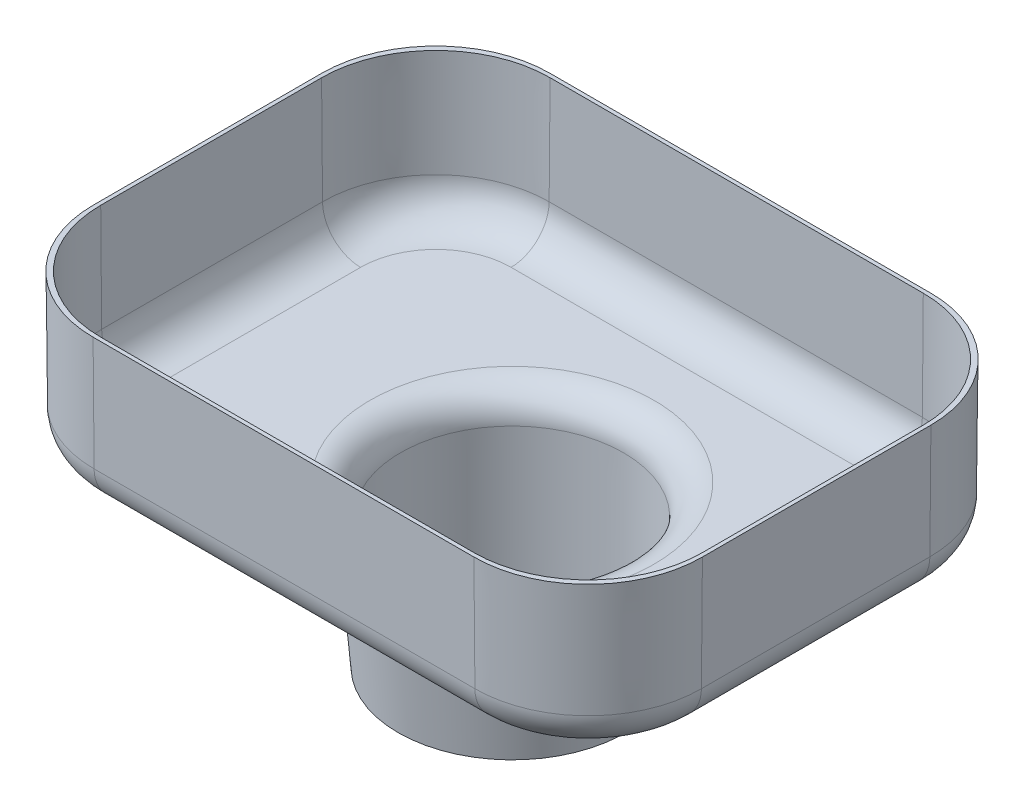
ISO-10303-21;
HEADER;
FILE_DESCRIPTION(('STEP AP214'),'2;1');
FILE_NAME('part.step','',(''),(''),'','','');
FILE_SCHEMA(('AUTOMOTIVE_DESIGN { 1 0 10303 214 1 1 1 1 }'));
ENDSEC;
DATA;
#1=APPLICATION_CONTEXT('core data for automotive mechanical design processes');
#2=APPLICATION_PROTOCOL_DEFINITION('international standard','automotive_design',2000,#1);
#3=PRODUCT_CONTEXT('',#1,'mechanical');
#4=PRODUCT('Part','Part','',(#3));
#5=PRODUCT_RELATED_PRODUCT_CATEGORY('part','',(#4));
#6=PRODUCT_DEFINITION_FORMATION('','',#4);
#7=PRODUCT_DEFINITION_CONTEXT('part definition',#1,'design');
#8=PRODUCT_DEFINITION('design','',#6,#7);
#9=PRODUCT_DEFINITION_SHAPE('','',#8);
#10=(LENGTH_UNIT() NAMED_UNIT(*) SI_UNIT(.MILLI.,.METRE.));
#11=(NAMED_UNIT(*) PLANE_ANGLE_UNIT() SI_UNIT($,.RADIAN.));
#12=(NAMED_UNIT(*) SI_UNIT($,.STERADIAN.) SOLID_ANGLE_UNIT());
#13=UNCERTAINTY_MEASURE_WITH_UNIT(LENGTH_MEASURE(1.E-05),#10,'distance_accuracy_value','');
#14=(GEOMETRIC_REPRESENTATION_CONTEXT(3) GLOBAL_UNCERTAINTY_ASSIGNED_CONTEXT((#13)) GLOBAL_UNIT_ASSIGNED_CONTEXT((#10,
#11,#12)) REPRESENTATION_CONTEXT('',''));
#15=CARTESIAN_POINT('',(0.,0.,0.));
#16=DIRECTION('',(0.,0.,1.));
#17=DIRECTION('',(1.,0.,0.));
#18=AXIS2_PLACEMENT_3D('',#15,#16,#17);
#19=CARTESIAN_POINT('',(36.9314006223956,0.,-13.3160309901822));
#20=DIRECTION('',(0.,1.,0.));
#21=DIRECTION('',(0.,0.,-1.));
#22=AXIS2_PLACEMENT_3D('',#19,#20,#21);
#23=CONICAL_SURFACE('',#22,19.05,0.00872664625997167);
#24=DIRECTION('',(0.00872653549837395,0.999961923064171,0.));
#25=VECTOR('',#24,1.);
#26=CARTESIAN_POINT('',(55.9814006223956,0.,-13.316030990182));
#27=LINE('',#26,#25);
#28=CARTESIAN_POINT('',(55.8146702046897,-19.1054135004147,-13.316030990182));
#29=VERTEX_POINT('',#28);
#30=CARTESIAN_POINT('',(55.9814006223956,0.,-13.316030990182));
#31=VERTEX_POINT('',#30);
#32=EDGE_CURVE('E306',#29,#31,#27,.T.);
#33=ORIENTED_EDGE('',*,*,#32,.F.);
#34=CARTESIAN_POINT('',(36.9314006223956,-19.1054135004145,-13.3160309901822));
#35=DIRECTION('',(0.,-1.,0.));
#36=DIRECTION('',(0.,0.,-1.));
#37=AXIS2_PLACEMENT_3D('',#34,#35,#36);
#38=CIRCLE('',#37,18.8832695822941);
#39=CARTESIAN_POINT('',(36.9314006223954,-19.1054135004147,-32.1993005724763));
#40=VERTEX_POINT('',#39);
#41=EDGE_CURVE('E376',#29,#40,#38,.F.);
#42=ORIENTED_EDGE('',*,*,#41,.T.);
#43=DIRECTION('',(0.,0.999961923064171,-0.00872653549837395));
#44=VECTOR('',#43,1.);
#45=CARTESIAN_POINT('',(36.9314006223954,0.,-32.3660309901822));
#46=LINE('',#45,#44);
#47=CARTESIAN_POINT('',(36.9314006223954,0.,-32.3660309901822));
#48=VERTEX_POINT('',#47);
#49=EDGE_CURVE('E305',#40,#48,#46,.T.);
#50=ORIENTED_EDGE('',*,*,#49,.T.);
#51=CARTESIAN_POINT('',(36.9314006223956,0.,-13.3160309901822));
#52=DIRECTION('',(0.,1.,0.));
#53=DIRECTION('',(0.,0.,-1.));
#54=AXIS2_PLACEMENT_3D('',#51,#52,#53);
#55=CIRCLE('',#54,19.05);
#56=EDGE_CURVE('E257',#31,#48,#55,.T.);
#57=ORIENTED_EDGE('',*,*,#56,.F.);
#58=EDGE_LOOP('',(#33,#42,#50,#57));
#59=FACE_BOUND('',#58,.T.);
#60=ADVANCED_FACE('F39',(#59),#23,.T.);
#61=CARTESIAN_POINT('',(55.9814006223956,0.,-13.316030990182));
#62=DIRECTION('',(0.999961923064171,-0.00872653549837395,0.));
#63=DIRECTION('',(0.00872653549837395,0.999961923064171,0.));
#64=AXIS2_PLACEMENT_3D('',#61,#62,#63);
#65=PLANE('',#64);
#66=DIRECTION('',(0.00872653549837395,0.999961923064171,0.));
#67=VECTOR('',#66,1.);
#68=CARTESIAN_POINT('',(55.9814006223956,0.,24.7839690098177));
#69=LINE('',#68,#67);
#70=CARTESIAN_POINT('',(55.8146702046897,-19.1054135004147,24.7839690098177));
#71=VERTEX_POINT('',#70);
#72=CARTESIAN_POINT('',(55.9814006223956,0.,24.7839690098177));
#73=VERTEX_POINT('',#72);
#74=EDGE_CURVE('E310',#71,#73,#69,.T.);
#75=ORIENTED_EDGE('',*,*,#74,.F.);
#76=DIRECTION('',(0.,0.,-1.));
#77=VECTOR('',#76,1.);
#78=CARTESIAN_POINT('',(55.8146702046897,-19.1054135004147,-13.316030990182));
#79=LINE('',#78,#77);
#80=EDGE_CURVE('E373',#71,#29,#79,.T.);
#81=ORIENTED_EDGE('',*,*,#80,.T.);
#82=ORIENTED_EDGE('',*,*,#32,.T.);
#83=DIRECTION('',(0.,0.,-1.));
#84=VECTOR('',#83,1.);
#85=CARTESIAN_POINT('',(55.9814006223956,0.,-13.316030990182));
#86=LINE('',#85,#84);
#87=EDGE_CURVE('E301',#73,#31,#86,.T.);
#88=ORIENTED_EDGE('',*,*,#87,.F.);
#89=EDGE_LOOP('',(#75,#81,#82,#88));
#90=FACE_BOUND('',#89,.T.);
#91=ADVANCED_FACE('F511',(#90),#65,.T.);
#92=CARTESIAN_POINT('',(36.9314006223956,0.,24.7839690098178));
#93=DIRECTION('',(0.,1.,0.));
#94=DIRECTION('',(0.,0.,1.));
#95=AXIS2_PLACEMENT_3D('',#92,#93,#94);
#96=CONICAL_SURFACE('',#95,19.05,0.00872664625997167);
#97=DIRECTION('',(0.,0.999961923064171,0.00872653549837395));
#98=VECTOR('',#97,1.);
#99=CARTESIAN_POINT('',(36.9314006223954,0.,43.8339690098178));
#100=LINE('',#99,#98);
#101=CARTESIAN_POINT('',(36.9314006223954,-19.1054135004147,43.6672385921119));
#102=VERTEX_POINT('',#101);
#103=CARTESIAN_POINT('',(36.9314006223954,0.,43.8339690098178));
#104=VERTEX_POINT('',#103);
#105=EDGE_CURVE('E325',#102,#104,#100,.T.);
#106=ORIENTED_EDGE('',*,*,#105,.F.);
#107=CARTESIAN_POINT('',(36.9314006223956,-19.1054135004145,24.7839690098178));
#108=DIRECTION('',(0.,-1.,0.));
#109=DIRECTION('',(0.,0.,-1.));
#110=AXIS2_PLACEMENT_3D('',#107,#108,#109);
#111=CIRCLE('',#110,18.8832695822941);
#112=EDGE_CURVE('E370',#102,#71,#111,.F.);
#113=ORIENTED_EDGE('',*,*,#112,.T.);
#114=ORIENTED_EDGE('',*,*,#74,.T.);
#115=CARTESIAN_POINT('',(36.9314006223956,0.,24.7839690098178));
#116=DIRECTION('',(0.,1.,0.));
#117=DIRECTION('',(0.,0.,1.));
#118=AXIS2_PLACEMENT_3D('',#115,#116,#117);
#119=CIRCLE('',#118,19.05);
#120=EDGE_CURVE('E297',#104,#73,#119,.T.);
#121=ORIENTED_EDGE('',*,*,#120,.F.);
#122=EDGE_LOOP('',(#106,#113,#114,#121));
#123=FACE_BOUND('',#122,.T.);
#124=ADVANCED_FACE('F517',(#123),#96,.T.);
#125=CARTESIAN_POINT('',(-26.5685993776043,0.,43.8339690098178));
#126=DIRECTION('',(0.,-0.00872653549837395,0.999961923064171));
#127=DIRECTION('',(0.,-0.999961923064171,-0.00872653549837395));
#128=AXIS2_PLACEMENT_3D('',#125,#126,#127);
#129=PLANE('',#128);
#130=DIRECTION('',(0.,0.999961923064171,0.00872653549837395));
#131=VECTOR('',#130,1.);
#132=CARTESIAN_POINT('',(-26.5685993776044,0.,43.8339690098178));
#133=LINE('',#132,#131);
#134=CARTESIAN_POINT('',(-26.5685993776044,-19.1054135004147,43.6672385921119));
#135=VERTEX_POINT('',#134);
#136=CARTESIAN_POINT('',(-26.5685993776044,0.,43.8339690098178));
#137=VERTEX_POINT('',#136);
#138=EDGE_CURVE('E322',#135,#137,#133,.T.);
#139=ORIENTED_EDGE('',*,*,#138,.F.);
#140=DIRECTION('',(1.,0.,0.));
#141=VECTOR('',#140,1.);
#142=CARTESIAN_POINT('',(-26.5685993776043,-19.1054135004147,43.6672385921119));
#143=LINE('',#142,#141);
#144=EDGE_CURVE('E367',#135,#102,#143,.T.);
#145=ORIENTED_EDGE('',*,*,#144,.T.);
#146=ORIENTED_EDGE('',*,*,#105,.T.);
#147=DIRECTION('',(1.,0.,0.));
#148=VECTOR('',#147,1.);
#149=CARTESIAN_POINT('',(-26.5685993776043,0.,43.8339690098178));
#150=LINE('',#149,#148);
#151=EDGE_CURVE('E293',#137,#104,#150,.T.);
#152=ORIENTED_EDGE('',*,*,#151,.F.);
#153=EDGE_LOOP('',(#139,#145,#146,#152));
#154=FACE_BOUND('',#153,.T.);
#155=ADVANCED_FACE('F540',(#154),#129,.T.);
#156=CARTESIAN_POINT('',(-26.5685993776044,0.,24.7839690098178));
#157=DIRECTION('',(0.,1.,0.));
#158=DIRECTION('',(0.,0.,1.));
#159=AXIS2_PLACEMENT_3D('',#156,#157,#158);
#160=CONICAL_SURFACE('',#159,19.05,0.00872664625997167);
#161=DIRECTION('',(-0.00872653549837395,0.999961923064171,0.));
#162=VECTOR('',#161,1.);
#163=CARTESIAN_POINT('',(-45.6185993776044,0.,24.7839690098177));
#164=LINE('',#163,#162);
#165=CARTESIAN_POINT('',(-45.4518689598985,-19.1054135004147,24.7839690098177));
#166=VERTEX_POINT('',#165);
#167=CARTESIAN_POINT('',(-45.6185993776044,0.,24.7839690098177));
#168=VERTEX_POINT('',#167);
#169=EDGE_CURVE('E319',#166,#168,#164,.T.);
#170=ORIENTED_EDGE('',*,*,#169,.F.);
#171=CARTESIAN_POINT('',(-26.5685993776044,-19.1054135004145,24.7839690098178));
#172=DIRECTION('',(0.,-1.,0.));
#173=DIRECTION('',(0.,0.,-1.));
#174=AXIS2_PLACEMENT_3D('',#171,#172,#173);
#175=CIRCLE('',#174,18.8832695822941);
#176=EDGE_CURVE('E364',#166,#135,#175,.F.);
#177=ORIENTED_EDGE('',*,*,#176,.T.);
#178=ORIENTED_EDGE('',*,*,#138,.T.);
#179=CARTESIAN_POINT('',(-26.5685993776044,0.,24.7839690098178));
#180=DIRECTION('',(0.,1.,0.));
#181=DIRECTION('',(0.,0.,1.));
#182=AXIS2_PLACEMENT_3D('',#179,#180,#181);
#183=CIRCLE('',#182,19.05);
#184=EDGE_CURVE('E289',#168,#137,#183,.T.);
#185=ORIENTED_EDGE('',*,*,#184,.F.);
#186=EDGE_LOOP('',(#170,#177,#178,#185));
#187=FACE_BOUND('',#186,.T.);
#188=ADVANCED_FACE('F536',(#187),#160,.T.);
#189=CARTESIAN_POINT('',(-45.6185993776044,0.,-13.316030990182));
#190=DIRECTION('',(-0.999961923064171,-0.00872653549837395,0.));
#191=DIRECTION('',(0.00872653549837395,-0.999961923064171,0.));
#192=AXIS2_PLACEMENT_3D('',#189,#190,#191);
#193=PLANE('',#192);
#194=DIRECTION('',(-0.00872653549837396,0.999961923064171,0.));
#195=VECTOR('',#194,1.);
#196=CARTESIAN_POINT('',(-45.6185993776044,0.,-13.316030990182));
#197=LINE('',#196,#195);
#198=CARTESIAN_POINT('',(-45.4518689598985,-19.1054135004147,-13.316030990182));
#199=VERTEX_POINT('',#198);
#200=CARTESIAN_POINT('',(-45.6185993776044,0.,-13.316030990182));
#201=VERTEX_POINT('',#200);
#202=EDGE_CURVE('E316',#199,#201,#197,.T.);
#203=ORIENTED_EDGE('',*,*,#202,.F.);
#204=DIRECTION('',(0.,0.,1.));
#205=VECTOR('',#204,1.);
#206=CARTESIAN_POINT('',(-45.4518689598985,-19.1054135004147,-13.316030990182));
#207=LINE('',#206,#205);
#208=EDGE_CURVE('E361',#199,#166,#207,.T.);
#209=ORIENTED_EDGE('',*,*,#208,.T.);
#210=ORIENTED_EDGE('',*,*,#169,.T.);
#211=DIRECTION('',(0.,0.,1.));
#212=VECTOR('',#211,1.);
#213=CARTESIAN_POINT('',(-45.6185993776044,0.,-13.316030990182));
#214=LINE('',#213,#212);
#215=EDGE_CURVE('E285',#201,#168,#214,.T.);
#216=ORIENTED_EDGE('',*,*,#215,.F.);
#217=EDGE_LOOP('',(#203,#209,#210,#216));
#218=FACE_BOUND('',#217,.T.);
#219=ADVANCED_FACE('F532',(#218),#193,.T.);
#220=CARTESIAN_POINT('',(-26.5685993776044,0.,-13.3160309901822));
#221=DIRECTION('',(0.,1.,0.));
#222=DIRECTION('',(0.,0.,1.));
#223=AXIS2_PLACEMENT_3D('',#220,#221,#222);
#224=CONICAL_SURFACE('',#223,19.05,0.00872664625997167);
#225=DIRECTION('',(0.,0.999961923064171,-0.00872653549837395));
#226=VECTOR('',#225,1.);
#227=CARTESIAN_POINT('',(-26.5685993776043,0.,-32.3660309901822));
#228=LINE('',#227,#226);
#229=CARTESIAN_POINT('',(-26.5685993776043,-19.1054135004147,-32.1993005724763));
#230=VERTEX_POINT('',#229);
#231=CARTESIAN_POINT('',(-26.5685993776043,0.,-32.3660309901822));
#232=VERTEX_POINT('',#231);
#233=EDGE_CURVE('E313',#230,#232,#228,.T.);
#234=ORIENTED_EDGE('',*,*,#233,.F.);
#235=CARTESIAN_POINT('',(-26.5685993776044,-19.1054135004145,-13.3160309901822));
#236=DIRECTION('',(0.,-1.,0.));
#237=DIRECTION('',(0.,0.,-1.));
#238=AXIS2_PLACEMENT_3D('',#235,#236,#237);
#239=CIRCLE('',#238,18.8832695822941);
#240=EDGE_CURVE('E358',#230,#199,#239,.F.);
#241=ORIENTED_EDGE('',*,*,#240,.T.);
#242=ORIENTED_EDGE('',*,*,#202,.T.);
#243=CARTESIAN_POINT('',(-26.5685993776044,0.,-13.3160309901822));
#244=DIRECTION('',(0.,1.,0.));
#245=DIRECTION('',(0.,0.,1.));
#246=AXIS2_PLACEMENT_3D('',#243,#244,#245);
#247=CIRCLE('',#246,19.05);
#248=EDGE_CURVE('E281',#232,#201,#247,.T.);
#249=ORIENTED_EDGE('',*,*,#248,.F.);
#250=EDGE_LOOP('',(#234,#241,#242,#249));
#251=FACE_BOUND('',#250,.T.);
#252=ADVANCED_FACE('F528',(#251),#224,.T.);
#253=CARTESIAN_POINT('',(-26.5685993776043,0.,-32.3660309901822));
#254=DIRECTION('',(0.,-0.00872653549837395,-0.999961923064171));
#255=DIRECTION('',(0.,0.999961923064171,-0.00872653549837395));
#256=AXIS2_PLACEMENT_3D('',#253,#254,#255);
#257=PLANE('',#256);
#258=ORIENTED_EDGE('',*,*,#49,.F.);
#259=DIRECTION('',(-1.,0.,0.));
#260=VECTOR('',#259,1.);
#261=CARTESIAN_POINT('',(-26.5685993776043,-19.1054135004147,-32.1993005724763));
#262=LINE('',#261,#260);
#263=EDGE_CURVE('E309',#40,#230,#262,.T.);
#264=ORIENTED_EDGE('',*,*,#263,.T.);
#265=ORIENTED_EDGE('',*,*,#233,.T.);
#266=DIRECTION('',(-1.,0.,0.));
#267=VECTOR('',#266,1.);
#268=CARTESIAN_POINT('',(-26.5685993776043,0.,-32.3660309901822));
#269=LINE('',#268,#267);
#270=EDGE_CURVE('E277',#48,#232,#269,.T.);
#271=ORIENTED_EDGE('',*,*,#270,.F.);
#272=EDGE_LOOP('',(#258,#264,#265,#271));
#273=FACE_BOUND('',#272,.T.);
#274=ADVANCED_FACE('F524',(#273),#257,.T.);
#275=CARTESIAN_POINT('',(36.9314006223956,-25.4,-13.3160309901822));
#276=DIRECTION('',(0.,-1.,0.));
#277=DIRECTION('',(0.,0.,-1.));
#278=AXIS2_PLACEMENT_3D('',#275,#276,#277);
#279=PLANE('',#278);
#280=CARTESIAN_POINT('',(5.18140062239554,-25.4,5.73396900981783));
#281=DIRECTION('',(0.,-1.,0.));
#282=DIRECTION('',(0.,0.,-1.));
#283=AXIS2_PLACEMENT_3D('',#280,#281,#282);
#284=CIRCLE('',#283,25.8639623640085);
#285=CARTESIAN_POINT('',(5.18140062239554,-25.4,-20.1299933541907));
#286=VERTEX_POINT('',#285);
#287=EDGE_CURVE('E11',#286,#286,#284,.F.);
#288=ORIENTED_EDGE('',*,*,#287,.T.);
#289=EDGE_LOOP('',(#288));
#290=FACE_BOUND('',#289,.T.);
#291=CARTESIAN_POINT('',(-26.5685993776044,-25.4,-13.3160309901822));
#292=DIRECTION('',(0.,-1.,0.));
#293=DIRECTION('',(0.,0.,-1.));
#294=AXIS2_PLACEMENT_3D('',#291,#292,#293);
#295=CIRCLE('',#294,12.5335113708366);
#296=CARTESIAN_POINT('',(-39.102110748441,-25.4,-13.3160309901821));
#297=VERTEX_POINT('',#296);
#298=CARTESIAN_POINT('',(-26.5685993776043,-25.4,-25.8495423610188));
#299=VERTEX_POINT('',#298);
#300=EDGE_CURVE('E351',#297,#299,#295,.T.);
#301=ORIENTED_EDGE('',*,*,#300,.T.);
#302=DIRECTION('',(-1.,0.,0.));
#303=VECTOR('',#302,1.);
#304=CARTESIAN_POINT('',(36.9314006223956,-25.4,-25.8495423610188));
#305=LINE('',#304,#303);
#306=CARTESIAN_POINT('',(36.9314006223954,-25.4,-25.8495423610188));
#307=VERTEX_POINT('',#306);
#308=EDGE_CURVE('E354',#299,#307,#305,.F.);
#309=ORIENTED_EDGE('',*,*,#308,.T.);
#310=CARTESIAN_POINT('',(36.9314006223956,-25.4,-13.3160309901822));
#311=DIRECTION('',(0.,-1.,0.));
#312=DIRECTION('',(0.,0.,-1.));
#313=AXIS2_PLACEMENT_3D('',#310,#311,#312);
#314=CIRCLE('',#313,12.5335113708366);
#315=CARTESIAN_POINT('',(49.4649119932322,-25.4,-13.316030990182));
#316=VERTEX_POINT('',#315);
#317=EDGE_CURVE('E333',#307,#316,#314,.T.);
#318=ORIENTED_EDGE('',*,*,#317,.T.);
#319=DIRECTION('',(0.,0.,-1.));
#320=VECTOR('',#319,1.);
#321=CARTESIAN_POINT('',(49.4649119932322,-25.4,-13.3160309901822));
#322=LINE('',#321,#320);
#323=CARTESIAN_POINT('',(49.4649119932322,-25.4,24.7839690098177));
#324=VERTEX_POINT('',#323);
#325=EDGE_CURVE('E336',#316,#324,#322,.F.);
#326=ORIENTED_EDGE('',*,*,#325,.T.);
#327=CARTESIAN_POINT('',(36.9314006223956,-25.4,24.7839690098178));
#328=DIRECTION('',(0.,-1.,0.));
#329=DIRECTION('',(0.,0.,-1.));
#330=AXIS2_PLACEMENT_3D('',#327,#328,#329);
#331=CIRCLE('',#330,12.5335113708366);
#332=CARTESIAN_POINT('',(36.9314006223954,-25.4,37.3174803806544));
#333=VERTEX_POINT('',#332);
#334=EDGE_CURVE('E339',#324,#333,#331,.T.);
#335=ORIENTED_EDGE('',*,*,#334,.T.);
#336=DIRECTION('',(1.,0.,0.));
#337=VECTOR('',#336,1.);
#338=CARTESIAN_POINT('',(36.9314006223956,-25.4,37.3174803806544));
#339=LINE('',#338,#337);
#340=CARTESIAN_POINT('',(-26.5685993776044,-25.4,37.3174803806544));
#341=VERTEX_POINT('',#340);
#342=EDGE_CURVE('E342',#333,#341,#339,.F.);
#343=ORIENTED_EDGE('',*,*,#342,.T.);
#344=CARTESIAN_POINT('',(-26.5685993776044,-25.4,24.7839690098178));
#345=DIRECTION('',(0.,-1.,0.));
#346=DIRECTION('',(0.,0.,-1.));
#347=AXIS2_PLACEMENT_3D('',#344,#345,#346);
#348=CIRCLE('',#347,12.5335113708366);
#349=CARTESIAN_POINT('',(-39.102110748441,-25.4,24.7839690098177));
#350=VERTEX_POINT('',#349);
#351=EDGE_CURVE('E345',#341,#350,#348,.T.);
#352=ORIENTED_EDGE('',*,*,#351,.T.);
#353=DIRECTION('',(0.,0.,1.));
#354=VECTOR('',#353,1.);
#355=CARTESIAN_POINT('',(-39.102110748441,-25.4,-13.3160309901822));
#356=LINE('',#355,#354);
#357=EDGE_CURVE('E348',#350,#297,#356,.F.);
#358=ORIENTED_EDGE('',*,*,#357,.T.);
#359=EDGE_LOOP('',(#301,#309,#318,#326,#335,#343,#352,#358));
#360=FACE_BOUND('',#359,.T.);
#361=ADVANCED_FACE('F527',(#290,#360),#279,.T.);
#362=CARTESIAN_POINT('',(36.9314006223956,0.,-13.3160309901822));
#363=DIRECTION('',(0.,-1.,0.));
#364=DIRECTION('',(0.,0.,-1.));
#365=AXIS2_PLACEMENT_3D('',#362,#363,#364);
#366=PLANE('',#365);
#367=DIRECTION('',(1.,0.,0.));
#368=VECTOR('',#367,1.);
#369=CARTESIAN_POINT('',(-25.9335993776044,0.,43.1989690098178));
#370=LINE('',#369,#368);
#371=CARTESIAN_POINT('',(-25.9335993776044,0.,43.1989690098178));
#372=VERTEX_POINT('',#371);
#373=CARTESIAN_POINT('',(36.2964006223956,0.,43.1989690098178));
#374=VERTEX_POINT('',#373);
#375=EDGE_CURVE('E218',#372,#374,#370,.T.);
#376=ORIENTED_EDGE('',*,*,#375,.F.);
#377=CARTESIAN_POINT('',(-25.9335993776044,0.,24.1489690098178));
#378=DIRECTION('',(0.,1.,0.));
#379=DIRECTION('',(0.,0.,1.));
#380=AXIS2_PLACEMENT_3D('',#377,#378,#379);
#381=CIRCLE('',#380,19.05);
#382=CARTESIAN_POINT('',(-44.9835993776044,0.,24.1489690098178));
#383=VERTEX_POINT('',#382);
#384=EDGE_CURVE('E225',#383,#372,#381,.T.);
#385=ORIENTED_EDGE('',*,*,#384,.F.);
#386=DIRECTION('',(0.,0.,1.));
#387=VECTOR('',#386,1.);
#388=CARTESIAN_POINT('',(-44.9835993776044,0.,-12.6810309901822));
#389=LINE('',#388,#387);
#390=CARTESIAN_POINT('',(-44.9835993776044,0.,-12.6810309901822));
#391=VERTEX_POINT('',#390);
#392=EDGE_CURVE('E250',#391,#383,#389,.T.);
#393=ORIENTED_EDGE('',*,*,#392,.F.);
#394=CARTESIAN_POINT('',(-25.9335993776044,0.,-12.6810309901822));
#395=DIRECTION('',(0.,1.,0.));
#396=DIRECTION('',(0.,0.,1.));
#397=AXIS2_PLACEMENT_3D('',#394,#395,#396);
#398=CIRCLE('',#397,19.05);
#399=CARTESIAN_POINT('',(-25.9335993776044,0.,-31.7310309901822));
#400=VERTEX_POINT('',#399);
#401=EDGE_CURVE('E246',#400,#391,#398,.T.);
#402=ORIENTED_EDGE('',*,*,#401,.F.);
#403=DIRECTION('',(-1.,0.,0.));
#404=VECTOR('',#403,1.);
#405=CARTESIAN_POINT('',(-25.9335993776044,0.,-31.7310309901822));
#406=LINE('',#405,#404);
#407=CARTESIAN_POINT('',(36.2964006223956,0.,-31.7310309901822));
#408=VERTEX_POINT('',#407);
#409=EDGE_CURVE('E242',#408,#400,#406,.T.);
#410=ORIENTED_EDGE('',*,*,#409,.F.);
#411=CARTESIAN_POINT('',(36.2964006223956,0.,-12.6810309901822));
#412=DIRECTION('',(0.,1.,0.));
#413=DIRECTION('',(0.,0.,-1.));
#414=AXIS2_PLACEMENT_3D('',#411,#412,#413);
#415=CIRCLE('',#414,19.05);
#416=CARTESIAN_POINT('',(55.3464006223956,0.,-12.6810309901822));
#417=VERTEX_POINT('',#416);
#418=EDGE_CURVE('E235',#417,#408,#415,.T.);
#419=ORIENTED_EDGE('',*,*,#418,.F.);
#420=DIRECTION('',(0.,0.,-1.));
#421=VECTOR('',#420,1.);
#422=CARTESIAN_POINT('',(55.3464006223956,0.,-12.6810309901822));
#423=LINE('',#422,#421);
#424=CARTESIAN_POINT('',(55.3464006223956,0.,24.1489690098178));
#425=VERTEX_POINT('',#424);
#426=EDGE_CURVE('E231',#425,#417,#423,.T.);
#427=ORIENTED_EDGE('',*,*,#426,.F.);
#428=CARTESIAN_POINT('',(36.2964006223956,0.,24.1489690098178));
#429=DIRECTION('',(0.,1.,0.));
#430=DIRECTION('',(0.,0.,1.));
#431=AXIS2_PLACEMENT_3D('',#428,#429,#430);
#432=CIRCLE('',#431,19.05);
#433=EDGE_CURVE('E207',#374,#425,#432,.T.);
#434=ORIENTED_EDGE('',*,*,#433,.F.);
#435=EDGE_LOOP('',(#376,#385,#393,#402,#410,#419,#427,#434));
#436=FACE_BOUND('',#435,.T.);
#437=ORIENTED_EDGE('',*,*,#56,.T.);
#438=ORIENTED_EDGE('',*,*,#270,.T.);
#439=ORIENTED_EDGE('',*,*,#248,.T.);
#440=ORIENTED_EDGE('',*,*,#215,.T.);
#441=ORIENTED_EDGE('',*,*,#184,.T.);
#442=ORIENTED_EDGE('',*,*,#151,.T.);
#443=ORIENTED_EDGE('',*,*,#120,.T.);
#444=ORIENTED_EDGE('',*,*,#87,.T.);
#445=EDGE_LOOP('',(#437,#438,#439,#440,#441,#442,#443,#444));
#446=FACE_BOUND('',#445,.T.);
#447=ADVANCED_FACE('F227',(#436,#446),#366,.F.);
#448=CARTESIAN_POINT('',(-25.9335993776044,0.,24.1489690098178));
#449=DIRECTION('',(0.,1.,0.));
#450=DIRECTION('',(0.,0.,1.));
#451=AXIS2_PLACEMENT_3D('',#448,#449,#450);
#452=CONICAL_SURFACE('',#451,19.05,0.00872664625997167);
#453=DIRECTION('',(0.,0.999961923064171,0.00872653549837395));
#454=VECTOR('',#453,1.);
#455=CARTESIAN_POINT('',(-25.9335993776044,0.,43.1989690098178));
#456=LINE('',#455,#454);
#457=CARTESIAN_POINT('',(-25.9335993776044,-17.8354135004147,43.0433217142062));
#458=VERTEX_POINT('',#457);
#459=EDGE_CURVE('E215',#458,#372,#456,.T.);
#460=ORIENTED_EDGE('',*,*,#459,.F.);
#461=CARTESIAN_POINT('',(-25.9335993776044,-17.8354135004146,24.1489690098178));
#462=DIRECTION('',(0.,-1.,0.));
#463=DIRECTION('',(0.,0.,-1.));
#464=AXIS2_PLACEMENT_3D('',#461,#462,#463);
#465=CIRCLE('',#464,18.8943527043884);
#466=CARTESIAN_POINT('',(-44.8279520819928,-17.8354135004147,24.1489690098178));
#467=VERTEX_POINT('',#466);
#468=EDGE_CURVE('E444',#458,#467,#465,.T.);
#469=ORIENTED_EDGE('',*,*,#468,.T.);
#470=DIRECTION('',(-0.00872653549837395,0.999961923064171,0.));
#471=VECTOR('',#470,1.);
#472=CARTESIAN_POINT('',(-44.9835993776044,0.,24.1489690098178));
#473=LINE('',#472,#471);
#474=EDGE_CURVE('E254',#467,#383,#473,.T.);
#475=ORIENTED_EDGE('',*,*,#474,.T.);
#476=ORIENTED_EDGE('',*,*,#384,.T.);
#477=EDGE_LOOP('',(#460,#469,#475,#476));
#478=FACE_BOUND('',#477,.T.);
#479=ADVANCED_FACE('F639',(#478),#452,.F.);
#480=CARTESIAN_POINT('',(-44.9835993776044,0.,-12.6810309901822));
#481=DIRECTION('',(-0.999961923064171,-0.00872653549837395,0.));
#482=DIRECTION('',(0.00872653549837395,-0.999961923064171,0.));
#483=AXIS2_PLACEMENT_3D('',#480,#481,#482);
#484=PLANE('',#483);
#485=ORIENTED_EDGE('',*,*,#474,.F.);
#486=DIRECTION('',(0.,0.,1.));
#487=VECTOR('',#486,1.);
#488=CARTESIAN_POINT('',(-44.8279520819928,-17.8354135004147,-12.6810309901822));
#489=LINE('',#488,#487);
#490=CARTESIAN_POINT('',(-44.8279520819928,-17.8354135004147,-12.6810309901822));
#491=VERTEX_POINT('',#490);
#492=EDGE_CURVE('E447',#467,#491,#489,.F.);
#493=ORIENTED_EDGE('',*,*,#492,.T.);
#494=DIRECTION('',(-0.00872653549837395,0.999961923064171,0.));
#495=VECTOR('',#494,1.);
#496=CARTESIAN_POINT('',(-44.9835993776044,0.,-12.6810309901822));
#497=LINE('',#496,#495);
#498=EDGE_CURVE('E258',#491,#391,#497,.T.);
#499=ORIENTED_EDGE('',*,*,#498,.T.);
#500=ORIENTED_EDGE('',*,*,#392,.T.);
#501=EDGE_LOOP('',(#485,#493,#499,#500));
#502=FACE_BOUND('',#501,.T.);
#503=ADVANCED_FACE('F654',(#502),#484,.F.);
#504=CARTESIAN_POINT('',(-25.9335993776044,0.,-12.6810309901822));
#505=DIRECTION('',(0.,1.,0.));
#506=DIRECTION('',(0.,0.,1.));
#507=AXIS2_PLACEMENT_3D('',#504,#505,#506);
#508=CONICAL_SURFACE('',#507,19.05,0.00872664625997167);
#509=ORIENTED_EDGE('',*,*,#498,.F.);
#510=CARTESIAN_POINT('',(-25.9335993776044,-17.8354135004146,-12.6810309901822));
#511=DIRECTION('',(0.,-1.,0.));
#512=DIRECTION('',(0.,0.,-1.));
#513=AXIS2_PLACEMENT_3D('',#510,#511,#512);
#514=CIRCLE('',#513,18.8943527043884);
#515=CARTESIAN_POINT('',(-25.9335993776044,-17.8354135004147,-31.5753836945705));
#516=VERTEX_POINT('',#515);
#517=EDGE_CURVE('E63',#491,#516,#514,.T.);
#518=ORIENTED_EDGE('',*,*,#517,.T.);
#519=DIRECTION('',(0.,0.999961923064171,-0.00872653549837395));
#520=VECTOR('',#519,1.);
#521=CARTESIAN_POINT('',(-25.9335993776044,0.,-31.7310309901822));
#522=LINE('',#521,#520);
#523=EDGE_CURVE('E269',#516,#400,#522,.T.);
#524=ORIENTED_EDGE('',*,*,#523,.T.);
#525=ORIENTED_EDGE('',*,*,#401,.T.);
#526=EDGE_LOOP('',(#509,#518,#524,#525));
#527=FACE_BOUND('',#526,.T.);
#528=ADVANCED_FACE('F665',(#527),#508,.F.);
#529=CARTESIAN_POINT('',(-25.9335993776044,0.,-31.7310309901822));
#530=DIRECTION('',(0.,-0.00872653549837395,-0.999961923064171));
#531=DIRECTION('',(0.,0.999961923064171,-0.00872653549837395));
#532=AXIS2_PLACEMENT_3D('',#529,#530,#531);
#533=PLANE('',#532);
#534=ORIENTED_EDGE('',*,*,#523,.F.);
#535=DIRECTION('',(-1.,0.,0.));
#536=VECTOR('',#535,1.);
#537=CARTESIAN_POINT('',(-25.9335993776044,-17.8354135004147,-31.5753836945705));
#538=LINE('',#537,#536);
#539=CARTESIAN_POINT('',(36.2964006223956,-17.8354135004147,-31.5753836945705));
#540=VERTEX_POINT('',#539);
#541=EDGE_CURVE('E55',#516,#540,#538,.F.);
#542=ORIENTED_EDGE('',*,*,#541,.T.);
#543=DIRECTION('',(0.,0.999961923064171,-0.00872653549837395));
#544=VECTOR('',#543,1.);
#545=CARTESIAN_POINT('',(36.2964006223956,0.,-31.7310309901822));
#546=LINE('',#545,#544);
#547=EDGE_CURVE('E266',#540,#408,#546,.T.);
#548=ORIENTED_EDGE('',*,*,#547,.T.);
#549=ORIENTED_EDGE('',*,*,#409,.T.);
#550=EDGE_LOOP('',(#534,#542,#548,#549));
#551=FACE_BOUND('',#550,.T.);
#552=ADVANCED_FACE('F662',(#551),#533,.F.);
#553=CARTESIAN_POINT('',(36.2964006223956,0.,-12.6810309901822));
#554=DIRECTION('',(0.,1.,0.));
#555=DIRECTION('',(0.,0.,-1.));
#556=AXIS2_PLACEMENT_3D('',#553,#554,#555);
#557=CONICAL_SURFACE('',#556,19.05,0.00872664625997167);
#558=ORIENTED_EDGE('',*,*,#547,.F.);
#559=CARTESIAN_POINT('',(36.2964006223956,-17.8354135004146,-12.6810309901822));
#560=DIRECTION('',(0.,-1.,0.));
#561=DIRECTION('',(0.,0.,-1.));
#562=AXIS2_PLACEMENT_3D('',#559,#560,#561);
#563=CIRCLE('',#562,18.8943527043884);
#564=CARTESIAN_POINT('',(55.1907533267839,-17.8354135004147,-12.6810309901822));
#565=VERTEX_POINT('',#564);
#566=EDGE_CURVE('E454',#540,#565,#563,.T.);
#567=ORIENTED_EDGE('',*,*,#566,.T.);
#568=DIRECTION('',(0.00872653549837395,0.999961923064171,0.));
#569=VECTOR('',#568,1.);
#570=CARTESIAN_POINT('',(55.3464006223956,0.,-12.6810309901822));
#571=LINE('',#570,#569);
#572=EDGE_CURVE('E263',#565,#417,#571,.T.);
#573=ORIENTED_EDGE('',*,*,#572,.T.);
#574=ORIENTED_EDGE('',*,*,#418,.T.);
#575=EDGE_LOOP('',(#558,#567,#573,#574));
#576=FACE_BOUND('',#575,.T.);
#577=ADVANCED_FACE('F627',(#576),#557,.F.);
#578=CARTESIAN_POINT('',(55.3464006223956,0.,-12.6810309901822));
#579=DIRECTION('',(0.999961923064171,-0.00872653549837395,0.));
#580=DIRECTION('',(0.00872653549837395,0.999961923064171,0.));
#581=AXIS2_PLACEMENT_3D('',#578,#579,#580);
#582=PLANE('',#581);
#583=ORIENTED_EDGE('',*,*,#572,.F.);
#584=DIRECTION('',(0.,0.,-1.));
#585=VECTOR('',#584,1.);
#586=CARTESIAN_POINT('',(55.1907533267839,-17.8354135004147,-12.6810309901822));
#587=LINE('',#586,#585);
#588=CARTESIAN_POINT('',(55.1907533267839,-17.8354135004147,24.1489690098178));
#589=VERTEX_POINT('',#588);
#590=EDGE_CURVE('E435',#565,#589,#587,.F.);
#591=ORIENTED_EDGE('',*,*,#590,.T.);
#592=DIRECTION('',(0.00872653549837395,0.999961923064171,0.));
#593=VECTOR('',#592,1.);
#594=CARTESIAN_POINT('',(55.3464006223956,0.,24.1489690098178));
#595=LINE('',#594,#593);
#596=EDGE_CURVE('E214',#589,#425,#595,.T.);
#597=ORIENTED_EDGE('',*,*,#596,.T.);
#598=ORIENTED_EDGE('',*,*,#426,.T.);
#599=EDGE_LOOP('',(#583,#591,#597,#598));
#600=FACE_BOUND('',#599,.T.);
#601=ADVANCED_FACE('F630',(#600),#582,.F.);
#602=CARTESIAN_POINT('',(36.2964006223956,0.,24.1489690098178));
#603=DIRECTION('',(0.,1.,0.));
#604=DIRECTION('',(0.,0.,1.));
#605=AXIS2_PLACEMENT_3D('',#602,#603,#604);
#606=CONICAL_SURFACE('',#605,19.05,0.00872664625997167);
#607=ORIENTED_EDGE('',*,*,#596,.F.);
#608=CARTESIAN_POINT('',(36.2964006223956,-17.8354135004146,24.1489690098178));
#609=DIRECTION('',(0.,-1.,0.));
#610=DIRECTION('',(0.,0.,-1.));
#611=AXIS2_PLACEMENT_3D('',#608,#609,#610);
#612=CIRCLE('',#611,18.8943527043884);
#613=CARTESIAN_POINT('',(36.2964006223956,-17.8354135004147,43.0433217142062));
#614=VERTEX_POINT('',#613);
#615=EDGE_CURVE('E210',#589,#614,#612,.T.);
#616=ORIENTED_EDGE('',*,*,#615,.T.);
#617=DIRECTION('',(0.,0.999961923064171,0.00872653549837395));
#618=VECTOR('',#617,1.);
#619=CARTESIAN_POINT('',(36.2964006223956,0.,43.1989690098178));
#620=LINE('',#619,#618);
#621=EDGE_CURVE('E202',#614,#374,#620,.T.);
#622=ORIENTED_EDGE('',*,*,#621,.T.);
#623=ORIENTED_EDGE('',*,*,#433,.T.);
#624=EDGE_LOOP('',(#607,#616,#622,#623));
#625=FACE_BOUND('',#624,.T.);
#626=ADVANCED_FACE('F205',(#625),#606,.F.);
#627=CARTESIAN_POINT('',(-25.9335993776044,0.,43.1989690098178));
#628=DIRECTION('',(0.,-0.00872653549837395,0.999961923064171));
#629=DIRECTION('',(0.,-0.999961923064171,-0.00872653549837396));
#630=AXIS2_PLACEMENT_3D('',#627,#628,#629);
#631=PLANE('',#630);
#632=ORIENTED_EDGE('',*,*,#621,.F.);
#633=DIRECTION('',(1.,0.,0.));
#634=VECTOR('',#633,1.);
#635=CARTESIAN_POINT('',(-25.9335993776044,-17.8354135004147,43.0433217142062));
#636=LINE('',#635,#634);
#637=EDGE_CURVE('E441',#614,#458,#636,.F.);
#638=ORIENTED_EDGE('',*,*,#637,.T.);
#639=ORIENTED_EDGE('',*,*,#459,.T.);
#640=ORIENTED_EDGE('',*,*,#375,.T.);
#641=EDGE_LOOP('',(#632,#638,#639,#640));
#642=FACE_BOUND('',#641,.T.);
#643=ADVANCED_FACE('F219',(#642),#631,.F.);
#644=CARTESIAN_POINT('',(-25.9335993776044,-24.13,24.1489690098178));
#645=DIRECTION('',(0.,1.,0.));
#646=DIRECTION('',(0.,0.,1.));
#647=AXIS2_PLACEMENT_3D('',#644,#645,#646);
#648=PLANE('',#647);
#649=CARTESIAN_POINT('',(5.18140062239554,-24.13,5.73396900981783));
#650=DIRECTION('',(0.,1.,0.));
#651=DIRECTION('',(0.,0.,1.));
#652=AXIS2_PLACEMENT_3D('',#649,#650,#651);
#653=CIRCLE('',#652,23.683606513802);
#654=CARTESIAN_POINT('',(5.18140062239554,-24.13,29.4175755236199));
#655=VERTEX_POINT('',#654);
#656=EDGE_CURVE('E457',#655,#655,#653,.F.);
#657=ORIENTED_EDGE('',*,*,#656,.T.);
#658=EDGE_LOOP('',(#657));
#659=FACE_BOUND('',#658,.T.);
#660=CARTESIAN_POINT('',(36.2964006223956,-24.13,24.1489690098178));
#661=DIRECTION('',(0.,1.,0.));
#662=DIRECTION('',(0.,0.,1.));
#663=AXIS2_PLACEMENT_3D('',#660,#661,#662);
#664=CIRCLE('',#663,12.5445944929309);
#665=CARTESIAN_POINT('',(36.2964006223956,-24.13,36.6935635027487));
#666=VERTEX_POINT('',#665);
#667=CARTESIAN_POINT('',(48.8409951153265,-24.13,24.1489690098178));
#668=VERTEX_POINT('',#667);
#669=EDGE_CURVE('E428',#666,#668,#664,.T.);
#670=ORIENTED_EDGE('',*,*,#669,.T.);
#671=DIRECTION('',(0.,0.,-1.));
#672=VECTOR('',#671,1.);
#673=CARTESIAN_POINT('',(48.8409951153265,-24.13,24.1489690098178));
#674=LINE('',#673,#672);
#675=CARTESIAN_POINT('',(48.8409951153265,-24.13,-12.6810309901822));
#676=VERTEX_POINT('',#675);
#677=EDGE_CURVE('E431',#668,#676,#674,.T.);
#678=ORIENTED_EDGE('',*,*,#677,.T.);
#679=CARTESIAN_POINT('',(36.2964006223956,-24.13,-12.6810309901822));
#680=DIRECTION('',(0.,1.,0.));
#681=DIRECTION('',(0.,0.,1.));
#682=AXIS2_PLACEMENT_3D('',#679,#680,#681);
#683=CIRCLE('',#682,12.5445944929309);
#684=CARTESIAN_POINT('',(36.2964006223956,-24.13,-25.225625483113));
#685=VERTEX_POINT('',#684);
#686=EDGE_CURVE('E379',#676,#685,#683,.T.);
#687=ORIENTED_EDGE('',*,*,#686,.T.);
#688=DIRECTION('',(-1.,0.,0.));
#689=VECTOR('',#688,1.);
#690=CARTESIAN_POINT('',(-25.9335993776044,-24.13,-25.2256254831131));
#691=LINE('',#690,#689);
#692=CARTESIAN_POINT('',(-25.9335993776044,-24.13,-25.2256254831131));
#693=VERTEX_POINT('',#692);
#694=EDGE_CURVE('E413',#685,#693,#691,.T.);
#695=ORIENTED_EDGE('',*,*,#694,.T.);
#696=CARTESIAN_POINT('',(-25.9335993776044,-24.13,-12.6810309901822));
#697=DIRECTION('',(0.,1.,0.));
#698=DIRECTION('',(0.,0.,1.));
#699=AXIS2_PLACEMENT_3D('',#696,#697,#698);
#700=CIRCLE('',#699,12.5445944929309);
#701=CARTESIAN_POINT('',(-38.4781938705353,-24.13,-12.6810309901822));
#702=VERTEX_POINT('',#701);
#703=EDGE_CURVE('E416',#693,#702,#700,.T.);
#704=ORIENTED_EDGE('',*,*,#703,.T.);
#705=DIRECTION('',(0.,0.,1.));
#706=VECTOR('',#705,1.);
#707=CARTESIAN_POINT('',(-38.4781938705353,-24.13,24.1489690098178));
#708=LINE('',#707,#706);
#709=CARTESIAN_POINT('',(-38.4781938705353,-24.13,24.1489690098178));
#710=VERTEX_POINT('',#709);
#711=EDGE_CURVE('E419',#702,#710,#708,.T.);
#712=ORIENTED_EDGE('',*,*,#711,.T.);
#713=CARTESIAN_POINT('',(-25.9335993776044,-24.13,24.1489690098178));
#714=DIRECTION('',(0.,1.,0.));
#715=DIRECTION('',(0.,0.,1.));
#716=AXIS2_PLACEMENT_3D('',#713,#714,#715);
#717=CIRCLE('',#716,12.5445944929309);
#718=CARTESIAN_POINT('',(-25.9335993776044,-24.13,36.6935635027487));
#719=VERTEX_POINT('',#718);
#720=EDGE_CURVE('E422',#710,#719,#717,.T.);
#721=ORIENTED_EDGE('',*,*,#720,.T.);
#722=DIRECTION('',(1.,0.,0.));
#723=VECTOR('',#722,1.);
#724=CARTESIAN_POINT('',(-25.9335993776044,-24.13,36.6935635027487));
#725=LINE('',#724,#723);
#726=EDGE_CURVE('E425',#719,#666,#725,.T.);
#727=ORIENTED_EDGE('',*,*,#726,.T.);
#728=EDGE_LOOP('',(#670,#678,#687,#695,#704,#712,#721,#727));
#729=FACE_BOUND('',#728,.T.);
#730=ADVANCED_FACE('F580',(#659,#729),#648,.T.);
#731=CARTESIAN_POINT('',(-26.5685993776043,-19.05,37.3174803806544));
#732=DIRECTION('',(1.,0.,0.));
#733=DIRECTION('',(0.,0.,-1.));
#734=AXIS2_PLACEMENT_3D('',#731,#732,#733);
#735=CYLINDRICAL_SURFACE('',#734,6.35);
#736=CARTESIAN_POINT('',(-26.5685993776044,-19.05,37.3174803806544));
#737=DIRECTION('',(-1.,0.,0.));
#738=DIRECTION('',(0.,0.,1.));
#739=AXIS2_PLACEMENT_3D('',#736,#737,#738);
#740=CIRCLE('',#739,6.35);
#741=EDGE_CURVE('E403',#341,#135,#740,.T.);
#742=ORIENTED_EDGE('',*,*,#741,.F.);
#743=ORIENTED_EDGE('',*,*,#342,.F.);
#744=CARTESIAN_POINT('',(36.9314006223954,-19.05,37.3174803806544));
#745=DIRECTION('',(1.,0.,0.));
#746=DIRECTION('',(0.,0.,-1.));
#747=AXIS2_PLACEMENT_3D('',#744,#745,#746);
#748=CIRCLE('',#747,6.35);
#749=EDGE_CURVE('E407',#102,#333,#748,.T.);
#750=ORIENTED_EDGE('',*,*,#749,.F.);
#751=ORIENTED_EDGE('',*,*,#144,.F.);
#752=EDGE_LOOP('',(#742,#743,#750,#751));
#753=FACE_BOUND('',#752,.T.);
#754=ADVANCED_FACE('F576',(#753),#735,.T.);
#755=CARTESIAN_POINT('',(36.9314006223956,-19.05,24.7839690098178));
#756=DIRECTION('',(0.,-1.,0.));
#757=DIRECTION('',(0.,0.,-1.));
#758=AXIS2_PLACEMENT_3D('',#755,#756,#757);
#759=TOROIDAL_SURFACE('',#758,12.5335113708366,6.35);
#760=ORIENTED_EDGE('',*,*,#749,.T.);
#761=ORIENTED_EDGE('',*,*,#334,.F.);
#762=CARTESIAN_POINT('',(49.4649119932322,-19.05,24.7839690098177));
#763=DIRECTION('',(0.,0.,-1.));
#764=DIRECTION('',(-1.,0.,0.));
#765=AXIS2_PLACEMENT_3D('',#762,#763,#764);
#766=CIRCLE('',#765,6.35);
#767=EDGE_CURVE('E399',#71,#324,#766,.T.);
#768=ORIENTED_EDGE('',*,*,#767,.F.);
#769=ORIENTED_EDGE('',*,*,#112,.F.);
#770=EDGE_LOOP('',(#760,#761,#768,#769));
#771=FACE_BOUND('',#770,.T.);
#772=ADVANCED_FACE('F572',(#771),#759,.T.);
#773=CARTESIAN_POINT('',(-26.5685993776044,-19.05,24.7839690098178));
#774=DIRECTION('',(0.,-1.,0.));
#775=DIRECTION('',(0.,0.,-1.));
#776=AXIS2_PLACEMENT_3D('',#773,#774,#775);
#777=TOROIDAL_SURFACE('',#776,12.5335113708366,6.35);
#778=ORIENTED_EDGE('',*,*,#741,.T.);
#779=ORIENTED_EDGE('',*,*,#176,.F.);
#780=CARTESIAN_POINT('',(-39.102110748441,-19.05,24.7839690098177));
#781=DIRECTION('',(0.,0.,-1.));
#782=DIRECTION('',(-1.,0.,0.));
#783=AXIS2_PLACEMENT_3D('',#780,#781,#782);
#784=CIRCLE('',#783,6.35);
#785=EDGE_CURVE('E395',#350,#166,#784,.T.);
#786=ORIENTED_EDGE('',*,*,#785,.F.);
#787=ORIENTED_EDGE('',*,*,#351,.F.);
#788=EDGE_LOOP('',(#778,#779,#786,#787));
#789=FACE_BOUND('',#788,.T.);
#790=ADVANCED_FACE('F568',(#789),#777,.T.);
#791=CARTESIAN_POINT('',(49.4649119932322,-19.05,-13.316030990182));
#792=DIRECTION('',(0.,0.,-1.));
#793=DIRECTION('',(-1.,0.,0.));
#794=AXIS2_PLACEMENT_3D('',#791,#792,#793);
#795=CYLINDRICAL_SURFACE('',#794,6.35);
#796=ORIENTED_EDGE('',*,*,#767,.T.);
#797=ORIENTED_EDGE('',*,*,#325,.F.);
#798=CARTESIAN_POINT('',(49.4649119932322,-19.05,-13.316030990182));
#799=DIRECTION('',(0.,0.,-1.));
#800=DIRECTION('',(-1.,0.,0.));
#801=AXIS2_PLACEMENT_3D('',#798,#799,#800);
#802=CIRCLE('',#801,6.35);
#803=EDGE_CURVE('E391',#29,#316,#802,.T.);
#804=ORIENTED_EDGE('',*,*,#803,.F.);
#805=ORIENTED_EDGE('',*,*,#80,.F.);
#806=EDGE_LOOP('',(#796,#797,#804,#805));
#807=FACE_BOUND('',#806,.T.);
#808=ADVANCED_FACE('F564',(#807),#795,.T.);
#809=CARTESIAN_POINT('',(-39.102110748441,-19.05,-13.316030990182));
#810=DIRECTION('',(0.,0.,1.));
#811=DIRECTION('',(1.,0.,0.));
#812=AXIS2_PLACEMENT_3D('',#809,#810,#811);
#813=CYLINDRICAL_SURFACE('',#812,6.35);
#814=ORIENTED_EDGE('',*,*,#785,.T.);
#815=ORIENTED_EDGE('',*,*,#208,.F.);
#816=CARTESIAN_POINT('',(-39.102110748441,-19.05,-13.3160309901821));
#817=DIRECTION('',(0.,0.,-1.));
#818=DIRECTION('',(-1.,0.,0.));
#819=AXIS2_PLACEMENT_3D('',#816,#817,#818);
#820=CIRCLE('',#819,6.35);
#821=EDGE_CURVE('E387',#297,#199,#820,.T.);
#822=ORIENTED_EDGE('',*,*,#821,.F.);
#823=ORIENTED_EDGE('',*,*,#357,.F.);
#824=EDGE_LOOP('',(#814,#815,#822,#823));
#825=FACE_BOUND('',#824,.T.);
#826=ADVANCED_FACE('F560',(#825),#813,.T.);
#827=CARTESIAN_POINT('',(36.9314006223956,-19.05,-13.3160309901822));
#828=DIRECTION('',(0.,-1.,0.));
#829=DIRECTION('',(0.,0.,-1.));
#830=AXIS2_PLACEMENT_3D('',#827,#828,#829);
#831=TOROIDAL_SURFACE('',#830,12.5335113708366,6.35);
#832=ORIENTED_EDGE('',*,*,#803,.T.);
#833=ORIENTED_EDGE('',*,*,#317,.F.);
#834=CARTESIAN_POINT('',(36.9314006223955,-19.05,-25.8495423610188));
#835=DIRECTION('',(-1.,0.,0.));
#836=DIRECTION('',(0.,-1.,0.));
#837=AXIS2_PLACEMENT_3D('',#834,#835,#836);
#838=CIRCLE('',#837,6.35);
#839=EDGE_CURVE('E383',#40,#307,#838,.T.);
#840=ORIENTED_EDGE('',*,*,#839,.F.);
#841=ORIENTED_EDGE('',*,*,#41,.F.);
#842=EDGE_LOOP('',(#832,#833,#840,#841));
#843=FACE_BOUND('',#842,.T.);
#844=ADVANCED_FACE('F556',(#843),#831,.T.);
#845=CARTESIAN_POINT('',(-26.5685993776044,-19.05,-13.3160309901822));
#846=DIRECTION('',(0.,-1.,0.));
#847=DIRECTION('',(0.,0.,-1.));
#848=AXIS2_PLACEMENT_3D('',#845,#846,#847);
#849=TOROIDAL_SURFACE('',#848,12.5335113708366,6.35);
#850=ORIENTED_EDGE('',*,*,#821,.T.);
#851=ORIENTED_EDGE('',*,*,#240,.F.);
#852=CARTESIAN_POINT('',(-26.5685993776043,-19.05,-25.8495423610188));
#853=DIRECTION('',(1.,0.,0.));
#854=DIRECTION('',(0.,0.,-1.));
#855=AXIS2_PLACEMENT_3D('',#852,#853,#854);
#856=CIRCLE('',#855,6.35);
#857=EDGE_CURVE('E380',#299,#230,#856,.T.);
#858=ORIENTED_EDGE('',*,*,#857,.F.);
#859=ORIENTED_EDGE('',*,*,#300,.F.);
#860=EDGE_LOOP('',(#850,#851,#858,#859));
#861=FACE_BOUND('',#860,.T.);
#862=ADVANCED_FACE('F552',(#861),#849,.T.);
#863=CARTESIAN_POINT('',(-26.5685993776043,-19.05,-25.8495423610188));
#864=DIRECTION('',(-1.,0.,0.));
#865=DIRECTION('',(0.,0.,1.));
#866=AXIS2_PLACEMENT_3D('',#863,#864,#865);
#867=CYLINDRICAL_SURFACE('',#866,6.35);
#868=ORIENTED_EDGE('',*,*,#839,.T.);
#869=ORIENTED_EDGE('',*,*,#308,.F.);
#870=ORIENTED_EDGE('',*,*,#857,.T.);
#871=ORIENTED_EDGE('',*,*,#263,.F.);
#872=EDGE_LOOP('',(#868,#869,#870,#871));
#873=FACE_BOUND('',#872,.T.);
#874=ADVANCED_FACE('F548',(#873),#867,.T.);
#875=CARTESIAN_POINT('',(-38.4781938705353,-17.78,24.1489690098178));
#876=DIRECTION('',(0.,0.,1.));
#877=DIRECTION('',(1.,0.,0.));
#878=AXIS2_PLACEMENT_3D('',#875,#876,#877);
#879=CYLINDRICAL_SURFACE('',#878,6.35);
#880=CARTESIAN_POINT('',(-38.4781938705353,-17.78,-12.6810309901822));
#881=DIRECTION('',(0.,0.,1.));
#882=DIRECTION('',(1.,0.,0.));
#883=AXIS2_PLACEMENT_3D('',#880,#881,#882);
#884=CIRCLE('',#883,6.35);
#885=EDGE_CURVE('E481',#491,#702,#884,.T.);
#886=ORIENTED_EDGE('',*,*,#885,.F.);
#887=ORIENTED_EDGE('',*,*,#492,.F.);
#888=CARTESIAN_POINT('',(-38.4781938705353,-17.78,24.1489690098178));
#889=DIRECTION('',(0.,0.,-1.));
#890=DIRECTION('',(-1.,0.,0.));
#891=AXIS2_PLACEMENT_3D('',#888,#889,#890);
#892=CIRCLE('',#891,6.35);
#893=EDGE_CURVE('E384',#710,#467,#892,.T.);
#894=ORIENTED_EDGE('',*,*,#893,.F.);
#895=ORIENTED_EDGE('',*,*,#711,.F.);
#896=EDGE_LOOP('',(#886,#887,#894,#895));
#897=FACE_BOUND('',#896,.T.);
#898=ADVANCED_FACE('F551',(#897),#879,.F.);
#899=CARTESIAN_POINT('',(-25.9335993776044,-17.78,24.1489690098178));
#900=DIRECTION('',(0.,1.,0.));
#901=DIRECTION('',(0.,0.,1.));
#902=AXIS2_PLACEMENT_3D('',#899,#900,#901);
#903=TOROIDAL_SURFACE('',#902,12.5445944929309,6.35);
#904=ORIENTED_EDGE('',*,*,#893,.T.);
#905=ORIENTED_EDGE('',*,*,#468,.F.);
#906=CARTESIAN_POINT('',(-25.9335993776044,-17.78,36.6935635027487));
#907=DIRECTION('',(-1.,0.,0.));
#908=DIRECTION('',(0.,0.,1.));
#909=AXIS2_PLACEMENT_3D('',#906,#907,#908);
#910=CIRCLE('',#909,6.35);
#911=EDGE_CURVE('E477',#719,#458,#910,.T.);
#912=ORIENTED_EDGE('',*,*,#911,.F.);
#913=ORIENTED_EDGE('',*,*,#720,.F.);
#914=EDGE_LOOP('',(#904,#905,#912,#913));
#915=FACE_BOUND('',#914,.T.);
#916=ADVANCED_FACE('F605',(#915),#903,.F.);
#917=CARTESIAN_POINT('',(-25.9335993776044,-17.78,-12.6810309901822));
#918=DIRECTION('',(0.,1.,0.));
#919=DIRECTION('',(0.,0.,1.));
#920=AXIS2_PLACEMENT_3D('',#917,#918,#919);
#921=TOROIDAL_SURFACE('',#920,12.5445944929309,6.35);
#922=ORIENTED_EDGE('',*,*,#885,.T.);
#923=ORIENTED_EDGE('',*,*,#703,.F.);
#924=CARTESIAN_POINT('',(-25.9335993776044,-17.78,-25.2256254831131));
#925=DIRECTION('',(-1.,0.,0.));
#926=DIRECTION('',(0.,0.,1.));
#927=AXIS2_PLACEMENT_3D('',#924,#925,#926);
#928=CIRCLE('',#927,6.35);
#929=EDGE_CURVE('E473',#516,#693,#928,.T.);
#930=ORIENTED_EDGE('',*,*,#929,.F.);
#931=ORIENTED_EDGE('',*,*,#517,.F.);
#932=EDGE_LOOP('',(#922,#923,#930,#931));
#933=FACE_BOUND('',#932,.T.);
#934=ADVANCED_FACE('F601',(#933),#921,.F.);
#935=CARTESIAN_POINT('',(-25.9335993776044,-17.78,36.6935635027487));
#936=DIRECTION('',(1.,0.,0.));
#937=DIRECTION('',(0.,0.,-1.));
#938=AXIS2_PLACEMENT_3D('',#935,#936,#937);
#939=CYLINDRICAL_SURFACE('',#938,6.35);
#940=ORIENTED_EDGE('',*,*,#911,.T.);
#941=ORIENTED_EDGE('',*,*,#637,.F.);
#942=CARTESIAN_POINT('',(36.2964006223956,-17.78,36.6935635027487));
#943=DIRECTION('',(-1.,0.,0.));
#944=DIRECTION('',(0.,0.,1.));
#945=AXIS2_PLACEMENT_3D('',#942,#943,#944);
#946=CIRCLE('',#945,6.35);
#947=EDGE_CURVE('E469',#666,#614,#946,.T.);
#948=ORIENTED_EDGE('',*,*,#947,.F.);
#949=ORIENTED_EDGE('',*,*,#726,.F.);
#950=EDGE_LOOP('',(#940,#941,#948,#949));
#951=FACE_BOUND('',#950,.T.);
#952=ADVANCED_FACE('F597',(#951),#939,.F.);
#953=CARTESIAN_POINT('',(-25.9335993776044,-17.78,-25.2256254831131));
#954=DIRECTION('',(-1.,0.,0.));
#955=DIRECTION('',(0.,0.,1.));
#956=AXIS2_PLACEMENT_3D('',#953,#954,#955);
#957=CYLINDRICAL_SURFACE('',#956,6.35);
#958=ORIENTED_EDGE('',*,*,#929,.T.);
#959=ORIENTED_EDGE('',*,*,#694,.F.);
#960=CARTESIAN_POINT('',(36.2964006223956,-17.78,-25.2256254831131));
#961=DIRECTION('',(-1.,0.,0.));
#962=DIRECTION('',(0.,0.,1.));
#963=AXIS2_PLACEMENT_3D('',#960,#961,#962);
#964=CIRCLE('',#963,6.35);
#965=EDGE_CURVE('E465',#540,#685,#964,.T.);
#966=ORIENTED_EDGE('',*,*,#965,.F.);
#967=ORIENTED_EDGE('',*,*,#541,.F.);
#968=EDGE_LOOP('',(#958,#959,#966,#967));
#969=FACE_BOUND('',#968,.T.);
#970=ADVANCED_FACE('F593',(#969),#957,.F.);
#971=CARTESIAN_POINT('',(36.2964006223956,-17.78,24.1489690098178));
#972=DIRECTION('',(0.,1.,0.));
#973=DIRECTION('',(0.,0.,1.));
#974=AXIS2_PLACEMENT_3D('',#971,#972,#973);
#975=TOROIDAL_SURFACE('',#974,12.5445944929309,6.35);
#976=ORIENTED_EDGE('',*,*,#947,.T.);
#977=ORIENTED_EDGE('',*,*,#615,.F.);
#978=CARTESIAN_POINT('',(48.8409951153265,-17.78,24.1489690098178));
#979=DIRECTION('',(0.,0.,1.));
#980=DIRECTION('',(1.,0.,0.));
#981=AXIS2_PLACEMENT_3D('',#978,#979,#980);
#982=CIRCLE('',#981,6.35);
#983=EDGE_CURVE('E461',#668,#589,#982,.T.);
#984=ORIENTED_EDGE('',*,*,#983,.F.);
#985=ORIENTED_EDGE('',*,*,#669,.F.);
#986=EDGE_LOOP('',(#976,#977,#984,#985));
#987=FACE_BOUND('',#986,.T.);
#988=ADVANCED_FACE('F589',(#987),#975,.F.);
#989=CARTESIAN_POINT('',(36.2964006223956,-17.78,-12.6810309901822));
#990=DIRECTION('',(0.,1.,0.));
#991=DIRECTION('',(0.,0.,1.));
#992=AXIS2_PLACEMENT_3D('',#989,#990,#991);
#993=TOROIDAL_SURFACE('',#992,12.5445944929309,6.35);
#994=ORIENTED_EDGE('',*,*,#965,.T.);
#995=ORIENTED_EDGE('',*,*,#686,.F.);
#996=CARTESIAN_POINT('',(48.8409951153265,-17.78,-12.6810309901822));
#997=DIRECTION('',(0.,0.,-1.));
#998=DIRECTION('',(-1.,0.,0.));
#999=AXIS2_PLACEMENT_3D('',#996,#997,#998);
#1000=CIRCLE('',#999,6.35);
#1001=EDGE_CURVE('E458',#565,#676,#1000,.T.);
#1002=ORIENTED_EDGE('',*,*,#1001,.F.);
#1003=ORIENTED_EDGE('',*,*,#566,.F.);
#1004=EDGE_LOOP('',(#994,#995,#1002,#1003));
#1005=FACE_BOUND('',#1004,.T.);
#1006=ADVANCED_FACE('F585',(#1005),#993,.F.);
#1007=CARTESIAN_POINT('',(48.8409951153265,-17.78,24.1489690098178));
#1008=DIRECTION('',(0.,0.,-1.));
#1009=DIRECTION('',(-1.,0.,0.));
#1010=AXIS2_PLACEMENT_3D('',#1007,#1008,#1009);
#1011=CYLINDRICAL_SURFACE('',#1010,6.35);
#1012=ORIENTED_EDGE('',*,*,#983,.T.);
#1013=ORIENTED_EDGE('',*,*,#590,.F.);
#1014=ORIENTED_EDGE('',*,*,#1001,.T.);
#1015=ORIENTED_EDGE('',*,*,#677,.F.);
#1016=EDGE_LOOP('',(#1012,#1013,#1014,#1015));
#1017=FACE_BOUND('',#1016,.T.);
#1018=ADVANCED_FACE('F582',(#1017),#1011,.F.);
#1019=CARTESIAN_POINT('',(5.18140062239554,-25.4,5.73396900981783));
#1020=DIRECTION('',(0.,1.,0.));
#1021=DIRECTION('',(0.,0.,-1.));
#1022=AXIS2_PLACEMENT_3D('',#1019,#1020,#1021);
#1023=CONICAL_SURFACE('',#1022,21.209,0.0872664625997167);
#1024=CARTESIAN_POINT('',(5.18140062239554,-30.0372488268419,5.73396900981783));
#1025=DIRECTION('',(0.,-1.,0.));
#1026=DIRECTION('',(0.,0.,-1.));
#1027=AXIS2_PLACEMENT_3D('',#1024,#1025,#1026);
#1028=CIRCLE('',#1027,20.8032932977024);
#1029=CARTESIAN_POINT('',(5.18140062239554,-30.0372488268419,-15.0693242878846));
#1030=VERTEX_POINT('',#1029);
#1031=EDGE_CURVE('E48',#1030,#1030,#1028,.T.);
#1032=ORIENTED_EDGE('',*,*,#1031,.T.);
#1033=EDGE_LOOP('',(#1032));
#1034=FACE_BOUND('',#1033,.T.);
#1035=CARTESIAN_POINT('',(5.18140062239554,-50.8,5.73396900981783));
#1036=DIRECTION('',(0.,-1.,0.));
#1037=DIRECTION('',(0.,0.,-1.));
#1038=AXIS2_PLACEMENT_3D('',#1035,#1036,#1037);
#1039=CIRCLE('',#1038,18.9867879464415);
#1040=CARTESIAN_POINT('',(5.18140062239554,-50.8,-13.2528189366237));
#1041=VERTEX_POINT('',#1040);
#1042=EDGE_CURVE('E462',#1041,#1041,#1039,.T.);
#1043=ORIENTED_EDGE('',*,*,#1042,.F.);
#1044=EDGE_LOOP('',(#1043));
#1045=FACE_BOUND('',#1044,.T.);
#1046=ADVANCED_FACE('F498',(#1034,#1045),#1023,.T.);
#1047=CARTESIAN_POINT('',(5.18140062239554,-50.8,5.73396900981783));
#1048=DIRECTION('',(0.,-1.,0.));
#1049=DIRECTION('',(0.,0.,-1.));
#1050=AXIS2_PLACEMENT_3D('',#1047,#1048,#1049);
#1051=PLANE('',#1050);
#1052=CARTESIAN_POINT('',(5.18140062239554,-50.8,5.73396900981783));
#1053=DIRECTION('',(0.,-1.,0.));
#1054=DIRECTION('',(0.,0.,-1.));
#1055=AXIS2_PLACEMENT_3D('',#1052,#1053,#1054);
#1056=CIRCLE('',#1055,18.415);
#1057=CARTESIAN_POINT('',(5.18140062239554,-50.8,-12.6810309901822));
#1058=VERTEX_POINT('',#1057);
#1059=EDGE_CURVE('E956',#1058,#1058,#1056,.T.);
#1060=ORIENTED_EDGE('',*,*,#1059,.F.);
#1061=EDGE_LOOP('',(#1060));
#1062=FACE_BOUND('',#1061,.T.);
#1063=ORIENTED_EDGE('',*,*,#1042,.T.);
#1064=EDGE_LOOP('',(#1063));
#1065=FACE_BOUND('',#1064,.T.);
#1066=ADVANCED_FACE('F805',(#1062,#1065),#1051,.T.);
#1067=CARTESIAN_POINT('',(5.18140062239554,-50.8,5.73396900981783));
#1068=DIRECTION('',(0.,1.,0.));
#1069=DIRECTION('',(0.,0.,-1.));
#1070=AXIS2_PLACEMENT_3D('',#1067,#1068,#1069);
#1071=CONICAL_SURFACE('',#1070,18.415,0.00872664625997167);
#1072=CARTESIAN_POINT('',(5.18140062239554,-29.1656691996683,5.73396900981783));
#1073=DIRECTION('',(0.,1.,0.));
#1074=DIRECTION('',(0.,0.,1.));
#1075=AXIS2_PLACEMENT_3D('',#1072,#1073,#1074);
#1076=CIRCLE('',#1075,18.603799944636);
#1077=CARTESIAN_POINT('',(5.18140062239554,-29.1656691996683,24.3377689544539));
#1078=VERTEX_POINT('',#1077);
#1079=EDGE_CURVE('E491',#1078,#1078,#1076,.T.);
#1080=ORIENTED_EDGE('',*,*,#1079,.T.);
#1081=EDGE_LOOP('',(#1080));
#1082=FACE_BOUND('',#1081,.T.);
#1083=ORIENTED_EDGE('',*,*,#1059,.T.);
#1084=EDGE_LOOP('',(#1083));
#1085=FACE_BOUND('',#1084,.T.);
#1086=ADVANCED_FACE('F507',(#1082,#1085),#1071,.F.);
#1087=CARTESIAN_POINT('',(5.18140062239554,-29.21,5.73396900981783));
#1088=DIRECTION('',(0.,1.,0.));
#1089=DIRECTION('',(0.,0.,1.));
#1090=AXIS2_PLACEMENT_3D('',#1087,#1088,#1089);
#1091=TOROIDAL_SURFACE('',#1090,23.683606513802,5.08);
#1092=ORIENTED_EDGE('',*,*,#1079,.F.);
#1093=EDGE_LOOP('',(#1092));
#1094=FACE_BOUND('',#1093,.T.);
#1095=ORIENTED_EDGE('',*,*,#656,.F.);
#1096=EDGE_LOOP('',(#1095));
#1097=FACE_BOUND('',#1096,.T.);
#1098=ADVANCED_FACE('F502',(#1094,#1097),#1091,.T.);
#1099=CARTESIAN_POINT('',(5.18140062239554,-30.48,5.73396900981783));
#1100=DIRECTION('',(0.,-1.,0.));
#1101=DIRECTION('',(0.,0.,-1.));
#1102=AXIS2_PLACEMENT_3D('',#1099,#1100,#1101);
#1103=TOROIDAL_SURFACE('',#1102,25.8639623640085,5.08);
#1104=ORIENTED_EDGE('',*,*,#287,.F.);
#1105=EDGE_LOOP('',(#1104));
#1106=FACE_BOUND('',#1105,.T.);
#1107=ORIENTED_EDGE('',*,*,#1031,.F.);
#1108=EDGE_LOOP('',(#1107));
#1109=FACE_BOUND('',#1108,.T.);
#1110=ADVANCED_FACE('F41',(#1106,#1109),#1103,.F.);
#1111=CLOSED_SHELL('',(#60,#91,#124,#155,#188,#219,#252,#274,#361,#447,#479,#503,#528,#552,#577,
#601,#626,#643,#730,#754,#772,#790,#808,#826,#844,#862,#874,#898,#916,#934,#952,#970,#988,#1006,
#1018,#1046,#1066,#1086,#1098,#1110));
#1112=MANIFOLD_SOLID_BREP('B2',#1111);
#1113=ADVANCED_BREP_SHAPE_REPRESENTATION('',(#18,#1112),#14);
#1114=SHAPE_DEFINITION_REPRESENTATION(#9,#1113);
ENDSEC;
END-ISO-10303-21;
